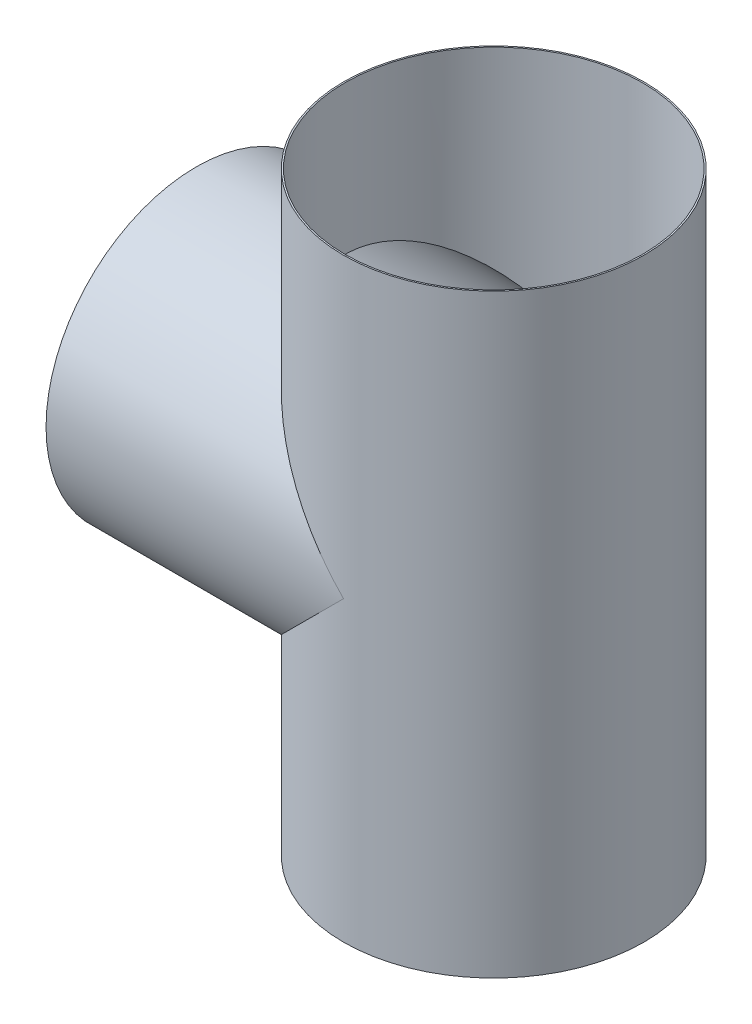
ISO-10303-21;
HEADER;
FILE_DESCRIPTION(('STEP AP214'),'2;1');
FILE_NAME('part.step','',(''),(''),'','','');
FILE_SCHEMA(('AUTOMOTIVE_DESIGN { 1 0 10303 214 1 1 1 1 }'));
ENDSEC;
DATA;
#1=APPLICATION_CONTEXT('core data for automotive mechanical design processes');
#2=APPLICATION_PROTOCOL_DEFINITION('international standard','automotive_design',2000,#1);
#3=PRODUCT_CONTEXT('',#1,'mechanical');
#4=PRODUCT('Part','Part','',(#3));
#5=PRODUCT_RELATED_PRODUCT_CATEGORY('part','',(#4));
#6=PRODUCT_DEFINITION_FORMATION('','',#4);
#7=PRODUCT_DEFINITION_CONTEXT('part definition',#1,'design');
#8=PRODUCT_DEFINITION('design','',#6,#7);
#9=PRODUCT_DEFINITION_SHAPE('','',#8);
#10=(LENGTH_UNIT() NAMED_UNIT(*) SI_UNIT(.MILLI.,.METRE.));
#11=(NAMED_UNIT(*) PLANE_ANGLE_UNIT() SI_UNIT($,.RADIAN.));
#12=(NAMED_UNIT(*) SI_UNIT($,.STERADIAN.) SOLID_ANGLE_UNIT());
#13=UNCERTAINTY_MEASURE_WITH_UNIT(LENGTH_MEASURE(1.E-05),#10,'distance_accuracy_value','');
#14=(GEOMETRIC_REPRESENTATION_CONTEXT(3) GLOBAL_UNCERTAINTY_ASSIGNED_CONTEXT((#13)) GLOBAL_UNIT_ASSIGNED_CONTEXT((#10,
#11,#12)) REPRESENTATION_CONTEXT('',''));
#15=CARTESIAN_POINT('',(0.,0.,0.));
#16=DIRECTION('',(0.,0.,1.));
#17=DIRECTION('',(1.,0.,0.));
#18=AXIS2_PLACEMENT_3D('',#15,#16,#17);
#19=CARTESIAN_POINT('',(200.,200.,0.));
#20=DIRECTION('',(-1.,0.,0.));
#21=DIRECTION('',(0.,0.,1.));
#22=AXIS2_PLACEMENT_3D('',#19,#20,#21);
#23=CYLINDRICAL_SURFACE('',#22,101.);
#24=CARTESIAN_POINT('',(0.,200.,0.));
#25=DIRECTION('',(1.,0.,0.));
#26=DIRECTION('',(0.,0.,-1.));
#27=AXIS2_PLACEMENT_3D('',#24,#25,#26);
#28=CIRCLE('',#27,101.);
#29=CARTESIAN_POINT('',(0.,200.,-101.));
#30=VERTEX_POINT('',#29);
#31=EDGE_CURVE('E68',#30,#30,#28,.T.);
#32=ORIENTED_EDGE('',*,*,#31,.T.);
#33=EDGE_LOOP('',(#32));
#34=FACE_BOUND('',#33,.T.);
#35=CARTESIAN_POINT('',(200.,200.,0.));
#36=DIRECTION('',(-0.707106781186547,-0.707106781186547,0.));
#37=DIRECTION('',(-0.707106781186547,0.707106781186547,0.));
#38=AXIS2_PLACEMENT_3D('',#35,#36,#37);
#39=ELLIPSE('',#38,142.835569799683,101.);
#40=CARTESIAN_POINT('',(200.,200.,-101.));
#41=VERTEX_POINT('',#40);
#42=CARTESIAN_POINT('',(200.,200.,101.));
#43=VERTEX_POINT('',#42);
#44=EDGE_CURVE('E95',#41,#43,#39,.F.);
#45=ORIENTED_EDGE('',*,*,#44,.F.);
#46=CARTESIAN_POINT('',(200.,200.,0.));
#47=DIRECTION('',(-0.707106781186547,0.707106781186547,0.));
#48=DIRECTION('',(-0.707106781186547,-0.707106781186547,0.));
#49=AXIS2_PLACEMENT_3D('',#46,#47,#48);
#50=ELLIPSE('',#49,142.835569799683,101.);
#51=EDGE_CURVE('E61',#43,#41,#50,.F.);
#52=ORIENTED_EDGE('',*,*,#51,.F.);
#53=EDGE_LOOP('',(#45,#52));
#54=FACE_BOUND('',#53,.T.);
#55=ADVANCED_FACE('F43',(#34,#54),#23,.T.);
#56=CARTESIAN_POINT('',(0.,200.,0.));
#57=DIRECTION('',(1.,0.,0.));
#58=DIRECTION('',(0.,0.,-1.));
#59=AXIS2_PLACEMENT_3D('',#56,#57,#58);
#60=PLANE('',#59);
#61=CARTESIAN_POINT('',(0.,200.,0.));
#62=DIRECTION('',(-1.,0.,0.));
#63=DIRECTION('',(0.,0.,1.));
#64=AXIS2_PLACEMENT_3D('',#61,#62,#63);
#65=CIRCLE('',#64,100.);
#66=CARTESIAN_POINT('',(0.,200.,100.));
#67=VERTEX_POINT('',#66);
#68=EDGE_CURVE('E82',#67,#67,#65,.T.);
#69=ORIENTED_EDGE('',*,*,#68,.F.);
#70=EDGE_LOOP('',(#69));
#71=FACE_BOUND('',#70,.T.);
#72=ORIENTED_EDGE('',*,*,#31,.F.);
#73=EDGE_LOOP('',(#72));
#74=FACE_BOUND('',#73,.T.);
#75=ADVANCED_FACE('F101',(#71,#74),#60,.F.);
#76=CARTESIAN_POINT('',(200.,400.,0.));
#77=DIRECTION('',(0.,-1.,0.));
#78=DIRECTION('',(0.,0.,-1.));
#79=AXIS2_PLACEMENT_3D('',#76,#77,#78);
#80=CYLINDRICAL_SURFACE('',#79,101.);
#81=CARTESIAN_POINT('',(200.,400.,0.));
#82=DIRECTION('',(0.,1.,0.));
#83=DIRECTION('',(0.,0.,1.));
#84=AXIS2_PLACEMENT_3D('',#81,#82,#83);
#85=CIRCLE('',#84,101.);
#86=CARTESIAN_POINT('',(200.,400.,101.));
#87=VERTEX_POINT('',#86);
#88=EDGE_CURVE('E89',#87,#87,#85,.T.);
#89=ORIENTED_EDGE('',*,*,#88,.F.);
#90=EDGE_LOOP('',(#89));
#91=FACE_BOUND('',#90,.T.);
#92=CARTESIAN_POINT('',(200.,0.,0.));
#93=DIRECTION('',(0.,1.,0.));
#94=DIRECTION('',(0.,0.,1.));
#95=AXIS2_PLACEMENT_3D('',#92,#93,#94);
#96=CIRCLE('',#95,101.);
#97=CARTESIAN_POINT('',(200.,0.,101.));
#98=VERTEX_POINT('',#97);
#99=EDGE_CURVE('E84',#98,#98,#96,.T.);
#100=ORIENTED_EDGE('',*,*,#99,.T.);
#101=EDGE_LOOP('',(#100));
#102=FACE_BOUND('',#101,.T.);
#103=ORIENTED_EDGE('',*,*,#51,.T.);
#104=ORIENTED_EDGE('',*,*,#44,.T.);
#105=EDGE_LOOP('',(#103,#104));
#106=FACE_BOUND('',#105,.T.);
#107=ADVANCED_FACE('F103',(#91,#102,#106),#80,.T.);
#108=CARTESIAN_POINT('',(200.,400.,0.));
#109=DIRECTION('',(0.,1.,0.));
#110=DIRECTION('',(0.,0.,1.));
#111=AXIS2_PLACEMENT_3D('',#108,#109,#110);
#112=PLANE('',#111);
#113=CARTESIAN_POINT('',(200.,400.,0.));
#114=DIRECTION('',(0.,1.,0.));
#115=DIRECTION('',(0.,0.,1.));
#116=AXIS2_PLACEMENT_3D('',#113,#114,#115);
#117=CIRCLE('',#116,100.);
#118=CARTESIAN_POINT('',(200.,400.,100.));
#119=VERTEX_POINT('',#118);
#120=EDGE_CURVE('E80',#119,#119,#117,.T.);
#121=ORIENTED_EDGE('',*,*,#120,.F.);
#122=EDGE_LOOP('',(#121));
#123=FACE_BOUND('',#122,.T.);
#124=ORIENTED_EDGE('',*,*,#88,.T.);
#125=EDGE_LOOP('',(#124));
#126=FACE_BOUND('',#125,.T.);
#127=ADVANCED_FACE('F109',(#123,#126),#112,.T.);
#128=CARTESIAN_POINT('',(200.,0.,0.));
#129=DIRECTION('',(0.,1.,0.));
#130=DIRECTION('',(0.,0.,1.));
#131=AXIS2_PLACEMENT_3D('',#128,#129,#130);
#132=PLANE('',#131);
#133=CARTESIAN_POINT('',(200.,0.,0.));
#134=DIRECTION('',(0.,1.,0.));
#135=DIRECTION('',(0.,0.,1.));
#136=AXIS2_PLACEMENT_3D('',#133,#134,#135);
#137=CIRCLE('',#136,100.);
#138=CARTESIAN_POINT('',(200.,0.,100.));
#139=VERTEX_POINT('',#138);
#140=EDGE_CURVE('E77',#139,#139,#137,.T.);
#141=ORIENTED_EDGE('',*,*,#140,.T.);
#142=EDGE_LOOP('',(#141));
#143=FACE_BOUND('',#142,.T.);
#144=ORIENTED_EDGE('',*,*,#99,.F.);
#145=EDGE_LOOP('',(#144));
#146=FACE_BOUND('',#145,.T.);
#147=ADVANCED_FACE('F72',(#143,#146),#132,.F.);
#148=CARTESIAN_POINT('',(200.,0.,0.));
#149=DIRECTION('',(0.,1.,0.));
#150=DIRECTION('',(0.,0.,1.));
#151=AXIS2_PLACEMENT_3D('',#148,#149,#150);
#152=CYLINDRICAL_SURFACE('',#151,100.);
#153=CARTESIAN_POINT('',(200.,200.,0.));
#154=DIRECTION('',(0.707106781186547,0.707106781186547,0.));
#155=DIRECTION('',(-0.707106781186547,0.707106781186547,0.));
#156=AXIS2_PLACEMENT_3D('',#153,#154,#155);
#157=ELLIPSE('',#156,141.42135623731,100.);
#158=CARTESIAN_POINT('',(200.,200.,100.));
#159=VERTEX_POINT('',#158);
#160=CARTESIAN_POINT('',(200.,200.,-100.));
#161=VERTEX_POINT('',#160);
#162=EDGE_CURVE('E50',#159,#161,#157,.F.);
#163=ORIENTED_EDGE('',*,*,#162,.T.);
#164=CARTESIAN_POINT('',(200.,200.,0.));
#165=DIRECTION('',(-0.707106781186547,0.707106781186547,0.));
#166=DIRECTION('',(0.707106781186547,0.707106781186547,0.));
#167=AXIS2_PLACEMENT_3D('',#164,#165,#166);
#168=ELLIPSE('',#167,141.42135623731,100.);
#169=EDGE_CURVE('E11',#161,#159,#168,.T.);
#170=ORIENTED_EDGE('',*,*,#169,.T.);
#171=EDGE_LOOP('',(#163,#170));
#172=FACE_BOUND('',#171,.T.);
#173=ORIENTED_EDGE('',*,*,#140,.F.);
#174=EDGE_LOOP('',(#173));
#175=FACE_BOUND('',#174,.T.);
#176=ORIENTED_EDGE('',*,*,#120,.T.);
#177=EDGE_LOOP('',(#176));
#178=FACE_BOUND('',#177,.T.);
#179=ADVANCED_FACE('F69',(#172,#175,#178),#152,.F.);
#180=CARTESIAN_POINT('',(200.,200.,0.));
#181=DIRECTION('',(-1.,0.,0.));
#182=DIRECTION('',(0.,0.,1.));
#183=AXIS2_PLACEMENT_3D('',#180,#181,#182);
#184=CYLINDRICAL_SURFACE('',#183,100.);
#185=ORIENTED_EDGE('',*,*,#68,.T.);
#186=EDGE_LOOP('',(#185));
#187=FACE_BOUND('',#186,.T.);
#188=ORIENTED_EDGE('',*,*,#162,.F.);
#189=ORIENTED_EDGE('',*,*,#169,.F.);
#190=EDGE_LOOP('',(#188,#189));
#191=FACE_BOUND('',#190,.T.);
#192=ADVANCED_FACE('F66',(#187,#191),#184,.F.);
#193=CLOSED_SHELL('',(#55,#75,#107,#127,#147,#179,#192));
#194=MANIFOLD_SOLID_BREP('B2',#193);
#195=ADVANCED_BREP_SHAPE_REPRESENTATION('',(#18,#194),#14);
#196=SHAPE_DEFINITION_REPRESENTATION(#9,#195);
ENDSEC;
END-ISO-10303-21;
